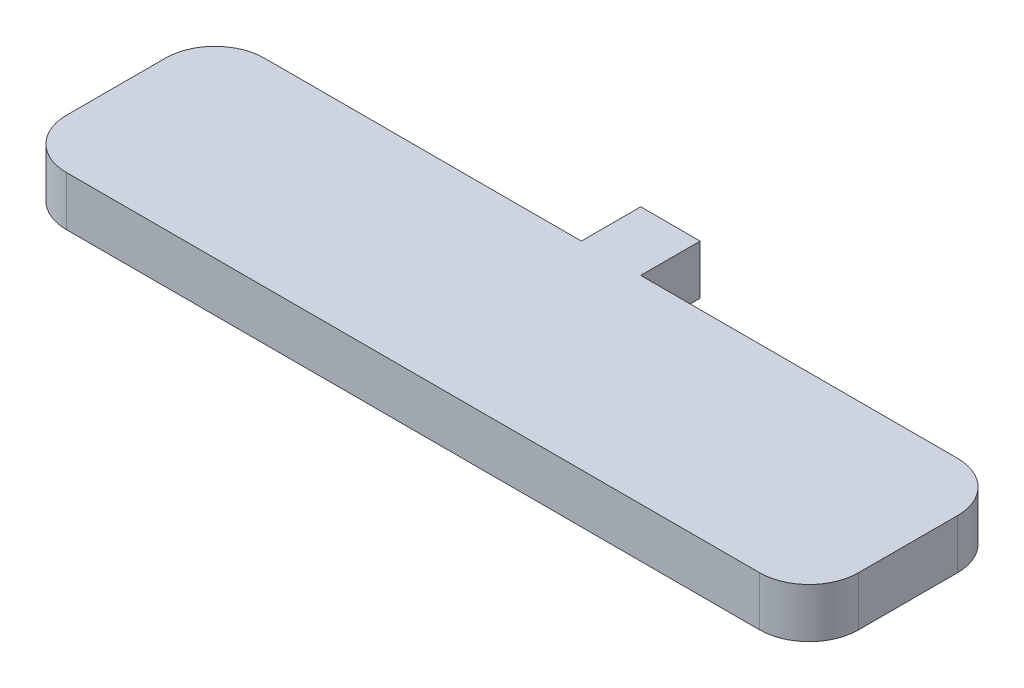
ISO-10303-21;
HEADER;
FILE_DESCRIPTION(('STEP AP214'),'2;1');
FILE_NAME('part.step','',(''),(''),'','','');
FILE_SCHEMA(('AUTOMOTIVE_DESIGN { 1 0 10303 214 1 1 1 1 }'));
ENDSEC;
DATA;
#1=APPLICATION_CONTEXT('core data for automotive mechanical design processes');
#2=APPLICATION_PROTOCOL_DEFINITION('international standard','automotive_design',2000,#1);
#3=PRODUCT_CONTEXT('',#1,'mechanical');
#4=PRODUCT('Part','Part','',(#3));
#5=PRODUCT_RELATED_PRODUCT_CATEGORY('part','',(#4));
#6=PRODUCT_DEFINITION_FORMATION('','',#4);
#7=PRODUCT_DEFINITION_CONTEXT('part definition',#1,'design');
#8=PRODUCT_DEFINITION('design','',#6,#7);
#9=PRODUCT_DEFINITION_SHAPE('','',#8);
#10=(LENGTH_UNIT() NAMED_UNIT(*) SI_UNIT(.MILLI.,.METRE.));
#11=(NAMED_UNIT(*) PLANE_ANGLE_UNIT() SI_UNIT($,.RADIAN.));
#12=(NAMED_UNIT(*) SI_UNIT($,.STERADIAN.) SOLID_ANGLE_UNIT());
#13=UNCERTAINTY_MEASURE_WITH_UNIT(LENGTH_MEASURE(1.E-05),#10,'distance_accuracy_value','');
#14=(GEOMETRIC_REPRESENTATION_CONTEXT(3) GLOBAL_UNCERTAINTY_ASSIGNED_CONTEXT((#13)) GLOBAL_UNIT_ASSIGNED_CONTEXT((#10,
#11,#12)) REPRESENTATION_CONTEXT('',''));
#15=CARTESIAN_POINT('',(0.,0.,0.));
#16=DIRECTION('',(0.,0.,1.));
#17=DIRECTION('',(1.,0.,0.));
#18=AXIS2_PLACEMENT_3D('',#15,#16,#17);
#19=CARTESIAN_POINT('',(40.,5.,-10.));
#20=DIRECTION('',(0.,0.,1.));
#21=DIRECTION('',(1.,0.,0.));
#22=AXIS2_PLACEMENT_3D('',#19,#20,#21);
#23=PLANE('',#22);
#24=DIRECTION('',(0.,1.,0.));
#25=VECTOR('',#24,1.);
#26=CARTESIAN_POINT('',(-3.,0.,-10.));
#27=LINE('',#26,#25);
#28=CARTESIAN_POINT('',(-3.,0.,-10.));
#29=VERTEX_POINT('',#28);
#30=CARTESIAN_POINT('',(-3.,5.,-10.));
#31=VERTEX_POINT('',#30);
#32=EDGE_CURVE('E55',#29,#31,#27,.T.);
#33=ORIENTED_EDGE('',*,*,#32,.F.);
#34=DIRECTION('',(-1.,0.,0.));
#35=VECTOR('',#34,1.);
#36=CARTESIAN_POINT('',(40.,0.,-10.));
#37=LINE('',#36,#35);
#38=CARTESIAN_POINT('',(-35.,0.,-10.));
#39=VERTEX_POINT('',#38);
#40=EDGE_CURVE('E316',#29,#39,#37,.T.);
#41=ORIENTED_EDGE('',*,*,#40,.T.);
#42=DIRECTION('',(0.,-1.,0.));
#43=VECTOR('',#42,1.);
#44=CARTESIAN_POINT('',(-35.,5.,-10.));
#45=LINE('',#44,#43);
#46=CARTESIAN_POINT('',(-35.,5.,-10.));
#47=VERTEX_POINT('',#46);
#48=EDGE_CURVE('E358',#39,#47,#45,.F.);
#49=ORIENTED_EDGE('',*,*,#48,.T.);
#50=DIRECTION('',(-1.,0.,0.));
#51=VECTOR('',#50,1.);
#52=CARTESIAN_POINT('',(40.,5.,-10.));
#53=LINE('',#52,#51);
#54=EDGE_CURVE('E300',#31,#47,#53,.T.);
#55=ORIENTED_EDGE('',*,*,#54,.F.);
#56=EDGE_LOOP('',(#33,#41,#49,#55));
#57=FACE_BOUND('',#56,.T.);
#58=ADVANCED_FACE('F39',(#57),#23,.F.);
#59=DIRECTION('',(0.,-1.,0.));
#60=VECTOR('',#59,1.);
#61=CARTESIAN_POINT('',(3.,0.,-10.));
#62=LINE('',#61,#60);
#63=CARTESIAN_POINT('',(3.,5.,-10.));
#64=VERTEX_POINT('',#63);
#65=CARTESIAN_POINT('',(3.,0.,-10.));
#66=VERTEX_POINT('',#65);
#67=EDGE_CURVE('E199',#64,#66,#62,.T.);
#68=ORIENTED_EDGE('',*,*,#67,.F.);
#69=CARTESIAN_POINT('',(35.,5.,-10.));
#70=VERTEX_POINT('',#69);
#71=EDGE_CURVE('E301',#70,#64,#53,.T.);
#72=ORIENTED_EDGE('',*,*,#71,.F.);
#73=DIRECTION('',(0.,-1.,0.));
#74=VECTOR('',#73,1.);
#75=CARTESIAN_POINT('',(35.,5.,-10.));
#76=LINE('',#75,#74);
#77=CARTESIAN_POINT('',(35.,0.,-10.));
#78=VERTEX_POINT('',#77);
#79=EDGE_CURVE('E362',#70,#78,#76,.T.);
#80=ORIENTED_EDGE('',*,*,#79,.T.);
#81=EDGE_CURVE('E293',#78,#66,#37,.T.);
#82=ORIENTED_EDGE('',*,*,#81,.T.);
#83=EDGE_LOOP('',(#68,#72,#80,#82));
#84=FACE_BOUND('',#83,.T.);
#85=ADVANCED_FACE('F401',(#84),#23,.F.);
#86=CARTESIAN_POINT('',(0.,0.,0.));
#87=DIRECTION('',(0.,1.,0.));
#88=DIRECTION('',(0.,0.,1.));
#89=AXIS2_PLACEMENT_3D('',#86,#87,#88);
#90=PLANE('',#89);
#91=DIRECTION('',(0.,0.,-1.));
#92=VECTOR('',#91,1.);
#93=CARTESIAN_POINT('',(40.,0.,9.99999999999999));
#94=LINE('',#93,#92);
#95=CARTESIAN_POINT('',(40.,0.,4.99999999999999));
#96=VERTEX_POINT('',#95);
#97=CARTESIAN_POINT('',(40.,0.,-5.00000000000001));
#98=VERTEX_POINT('',#97);
#99=EDGE_CURVE('E312',#96,#98,#94,.T.);
#100=ORIENTED_EDGE('',*,*,#99,.F.);
#101=CARTESIAN_POINT('',(35.,0.,4.99999999999999));
#102=DIRECTION('',(0.,1.,0.));
#103=DIRECTION('',(0.,0.,1.));
#104=AXIS2_PLACEMENT_3D('',#101,#102,#103);
#105=CIRCLE('',#104,5.);
#106=CARTESIAN_POINT('',(35.,0.,9.99999999999999));
#107=VERTEX_POINT('',#106);
#108=EDGE_CURVE('E336',#96,#107,#105,.F.);
#109=ORIENTED_EDGE('',*,*,#108,.T.);
#110=DIRECTION('',(1.,0.,0.));
#111=VECTOR('',#110,1.);
#112=CARTESIAN_POINT('',(40.,0.,9.99999999999999));
#113=LINE('',#112,#111);
#114=CARTESIAN_POINT('',(-35.,0.,9.99999999999999));
#115=VERTEX_POINT('',#114);
#116=EDGE_CURVE('E308',#115,#107,#113,.T.);
#117=ORIENTED_EDGE('',*,*,#116,.F.);
#118=CARTESIAN_POINT('',(-35.,0.,4.99999999999999));
#119=DIRECTION('',(0.,1.,0.));
#120=DIRECTION('',(0.,0.,1.));
#121=AXIS2_PLACEMENT_3D('',#118,#119,#120);
#122=CIRCLE('',#121,5.);
#123=CARTESIAN_POINT('',(-40.,0.,4.99999999999999));
#124=VERTEX_POINT('',#123);
#125=EDGE_CURVE('E326',#115,#124,#122,.F.);
#126=ORIENTED_EDGE('',*,*,#125,.T.);
#127=DIRECTION('',(0.,0.,1.));
#128=VECTOR('',#127,1.);
#129=CARTESIAN_POINT('',(-40.,0.,9.99999999999999));
#130=LINE('',#129,#128);
#131=CARTESIAN_POINT('',(-40.,0.,-5.));
#132=VERTEX_POINT('',#131);
#133=EDGE_CURVE('E222',#132,#124,#130,.T.);
#134=ORIENTED_EDGE('',*,*,#133,.F.);
#135=CARTESIAN_POINT('',(-35.,0.,-5.));
#136=DIRECTION('',(0.,1.,0.));
#137=DIRECTION('',(0.,0.,1.));
#138=AXIS2_PLACEMENT_3D('',#135,#136,#137);
#139=CIRCLE('',#138,5.);
#140=EDGE_CURVE('E329',#132,#39,#139,.F.);
#141=ORIENTED_EDGE('',*,*,#140,.T.);
#142=ORIENTED_EDGE('',*,*,#40,.F.);
#143=DIRECTION('',(0.,0.,1.));
#144=VECTOR('',#143,1.);
#145=CARTESIAN_POINT('',(-3.,0.,-16.));
#146=LINE('',#145,#144);
#147=CARTESIAN_POINT('',(-3.,0.,-16.));
#148=VERTEX_POINT('',#147);
#149=EDGE_CURVE('E406',#148,#29,#146,.T.);
#150=ORIENTED_EDGE('',*,*,#149,.F.);
#151=DIRECTION('',(-1.,0.,0.));
#152=VECTOR('',#151,1.);
#153=CARTESIAN_POINT('',(-3.,0.,-16.));
#154=LINE('',#153,#152);
#155=CARTESIAN_POINT('',(3.,0.,-16.));
#156=VERTEX_POINT('',#155);
#157=EDGE_CURVE('E196',#156,#148,#154,.T.);
#158=ORIENTED_EDGE('',*,*,#157,.F.);
#159=DIRECTION('',(0.,0.,1.));
#160=VECTOR('',#159,1.);
#161=CARTESIAN_POINT('',(3.,0.,-16.));
#162=LINE('',#161,#160);
#163=EDGE_CURVE('E210',#156,#66,#162,.T.);
#164=ORIENTED_EDGE('',*,*,#163,.T.);
#165=ORIENTED_EDGE('',*,*,#81,.F.);
#166=CARTESIAN_POINT('',(35.,0.,-5.00000000000001));
#167=DIRECTION('',(0.,1.,0.));
#168=DIRECTION('',(0.,0.,1.));
#169=AXIS2_PLACEMENT_3D('',#166,#167,#168);
#170=CIRCLE('',#169,5.);
#171=EDGE_CURVE('E333',#78,#98,#170,.F.);
#172=ORIENTED_EDGE('',*,*,#171,.T.);
#173=EDGE_LOOP('',(#100,#109,#117,#126,#134,#141,#142,#150,#158,#164,#165,#172));
#174=FACE_BOUND('',#173,.T.);
#175=CARTESIAN_POINT('',(35.,0.,4.99999999999999));
#176=DIRECTION('',(0.,1.,0.));
#177=DIRECTION('',(0.,0.,1.));
#178=AXIS2_PLACEMENT_3D('',#175,#176,#177);
#179=CIRCLE('',#178,3.);
#180=CARTESIAN_POINT('',(38.,0.,4.99999999999999));
#181=VERTEX_POINT('',#180);
#182=CARTESIAN_POINT('',(35.,0.,7.99999999999999));
#183=VERTEX_POINT('',#182);
#184=EDGE_CURVE('E258',#181,#183,#179,.F.);
#185=ORIENTED_EDGE('',*,*,#184,.F.);
#186=DIRECTION('',(0.,0.,-1.));
#187=VECTOR('',#186,1.);
#188=CARTESIAN_POINT('',(38.,0.,9.99999999999999));
#189=LINE('',#188,#187);
#190=CARTESIAN_POINT('',(38.,0.,-5.00000000000001));
#191=VERTEX_POINT('',#190);
#192=EDGE_CURVE('E275',#181,#191,#189,.T.);
#193=ORIENTED_EDGE('',*,*,#192,.T.);
#194=CARTESIAN_POINT('',(35.,0.,-5.00000000000001));
#195=DIRECTION('',(0.,1.,0.));
#196=DIRECTION('',(0.,0.,1.));
#197=AXIS2_PLACEMENT_3D('',#194,#195,#196);
#198=CIRCLE('',#197,3.);
#199=CARTESIAN_POINT('',(35.,0.,-8.00000000000001));
#200=VERTEX_POINT('',#199);
#201=EDGE_CURVE('E272',#200,#191,#198,.F.);
#202=ORIENTED_EDGE('',*,*,#201,.F.);
#203=DIRECTION('',(-1.,0.,0.));
#204=VECTOR('',#203,1.);
#205=CARTESIAN_POINT('',(40.,0.,-8.00000000000001));
#206=LINE('',#205,#204);
#207=CARTESIAN_POINT('',(-35.,0.,-8.00000000000001));
#208=VERTEX_POINT('',#207);
#209=EDGE_CURVE('E63',#200,#208,#206,.T.);
#210=ORIENTED_EDGE('',*,*,#209,.T.);
#211=CARTESIAN_POINT('',(-35.,0.,-5.));
#212=DIRECTION('',(0.,1.,0.));
#213=DIRECTION('',(0.,0.,1.));
#214=AXIS2_PLACEMENT_3D('',#211,#212,#213);
#215=CIRCLE('',#214,3.);
#216=CARTESIAN_POINT('',(-38.,0.,-5.));
#217=VERTEX_POINT('',#216);
#218=EDGE_CURVE('E269',#217,#208,#215,.F.);
#219=ORIENTED_EDGE('',*,*,#218,.F.);
#220=DIRECTION('',(0.,0.,1.));
#221=VECTOR('',#220,1.);
#222=CARTESIAN_POINT('',(-38.,0.,9.99999999999999));
#223=LINE('',#222,#221);
#224=CARTESIAN_POINT('',(-38.,0.,4.99999999999999));
#225=VERTEX_POINT('',#224);
#226=EDGE_CURVE('E203',#217,#225,#223,.T.);
#227=ORIENTED_EDGE('',*,*,#226,.T.);
#228=CARTESIAN_POINT('',(-35.,0.,4.99999999999999));
#229=DIRECTION('',(0.,1.,0.));
#230=DIRECTION('',(0.,0.,1.));
#231=AXIS2_PLACEMENT_3D('',#228,#229,#230);
#232=CIRCLE('',#231,3.);
#233=CARTESIAN_POINT('',(-35.,0.,7.99999999999999));
#234=VERTEX_POINT('',#233);
#235=EDGE_CURVE('E262',#234,#225,#232,.F.);
#236=ORIENTED_EDGE('',*,*,#235,.F.);
#237=DIRECTION('',(1.,0.,0.));
#238=VECTOR('',#237,1.);
#239=CARTESIAN_POINT('',(40.,0.,7.99999999999999));
#240=LINE('',#239,#238);
#241=EDGE_CURVE('E208',#234,#183,#240,.T.);
#242=ORIENTED_EDGE('',*,*,#241,.T.);
#243=EDGE_LOOP('',(#185,#193,#202,#210,#219,#227,#236,#242));
#244=FACE_BOUND('',#243,.T.);
#245=ADVANCED_FACE('F383',(#174,#244),#90,.F.);
#246=CARTESIAN_POINT('',(-40.,5.,9.99999999999999));
#247=DIRECTION('',(1.,0.,0.));
#248=DIRECTION('',(0.,0.,-1.));
#249=AXIS2_PLACEMENT_3D('',#246,#247,#248);
#250=PLANE('',#249);
#251=DIRECTION('',(0.,0.,1.));
#252=VECTOR('',#251,1.);
#253=CARTESIAN_POINT('',(-40.,5.,9.99999999999999));
#254=LINE('',#253,#252);
#255=CARTESIAN_POINT('',(-40.,5.,-5.));
#256=VERTEX_POINT('',#255);
#257=CARTESIAN_POINT('',(-40.,5.,4.99999999999999));
#258=VERTEX_POINT('',#257);
#259=EDGE_CURVE('E288',#256,#258,#254,.T.);
#260=ORIENTED_EDGE('',*,*,#259,.F.);
#261=DIRECTION('',(0.,-1.,0.));
#262=VECTOR('',#261,1.);
#263=CARTESIAN_POINT('',(-40.,5.,-5.));
#264=LINE('',#263,#262);
#265=EDGE_CURVE('E11',#256,#132,#264,.T.);
#266=ORIENTED_EDGE('',*,*,#265,.T.);
#267=ORIENTED_EDGE('',*,*,#133,.T.);
#268=DIRECTION('',(0.,-1.,0.));
#269=VECTOR('',#268,1.);
#270=CARTESIAN_POINT('',(-40.,5.,4.99999999999999));
#271=LINE('',#270,#269);
#272=EDGE_CURVE('E48',#124,#258,#271,.F.);
#273=ORIENTED_EDGE('',*,*,#272,.T.);
#274=EDGE_LOOP('',(#260,#266,#267,#273));
#275=FACE_BOUND('',#274,.T.);
#276=ADVANCED_FACE('F369',(#275),#250,.F.);
#277=CARTESIAN_POINT('',(40.,5.,9.99999999999999));
#278=DIRECTION('',(0.,0.,-1.));
#279=DIRECTION('',(-1.,0.,0.));
#280=AXIS2_PLACEMENT_3D('',#277,#278,#279);
#281=PLANE('',#280);
#282=ORIENTED_EDGE('',*,*,#116,.T.);
#283=DIRECTION('',(0.,-1.,0.));
#284=VECTOR('',#283,1.);
#285=CARTESIAN_POINT('',(35.,5.,9.99999999999999));
#286=LINE('',#285,#284);
#287=CARTESIAN_POINT('',(35.,5.,9.99999999999999));
#288=VERTEX_POINT('',#287);
#289=EDGE_CURVE('E343',#107,#288,#286,.F.);
#290=ORIENTED_EDGE('',*,*,#289,.T.);
#291=DIRECTION('',(1.,0.,0.));
#292=VECTOR('',#291,1.);
#293=CARTESIAN_POINT('',(40.,5.,9.99999999999999));
#294=LINE('',#293,#292);
#295=CARTESIAN_POINT('',(-35.,5.,9.99999999999999));
#296=VERTEX_POINT('',#295);
#297=EDGE_CURVE('E292',#296,#288,#294,.T.);
#298=ORIENTED_EDGE('',*,*,#297,.F.);
#299=DIRECTION('',(0.,-1.,0.));
#300=VECTOR('',#299,1.);
#301=CARTESIAN_POINT('',(-35.,5.,9.99999999999999));
#302=LINE('',#301,#300);
#303=EDGE_CURVE('E339',#296,#115,#302,.T.);
#304=ORIENTED_EDGE('',*,*,#303,.T.);
#305=EDGE_LOOP('',(#282,#290,#298,#304));
#306=FACE_BOUND('',#305,.T.);
#307=ADVANCED_FACE('F379',(#306),#281,.F.);
#308=CARTESIAN_POINT('',(40.,5.,9.99999999999999));
#309=DIRECTION('',(-1.,0.,0.));
#310=DIRECTION('',(0.,0.,1.));
#311=AXIS2_PLACEMENT_3D('',#308,#309,#310);
#312=PLANE('',#311);
#313=DIRECTION('',(0.,0.,-1.));
#314=VECTOR('',#313,1.);
#315=CARTESIAN_POINT('',(40.,5.,9.99999999999999));
#316=LINE('',#315,#314);
#317=CARTESIAN_POINT('',(40.,5.,4.99999999999999));
#318=VERTEX_POINT('',#317);
#319=CARTESIAN_POINT('',(40.,5.,-5.00000000000001));
#320=VERTEX_POINT('',#319);
#321=EDGE_CURVE('E296',#318,#320,#316,.T.);
#322=ORIENTED_EDGE('',*,*,#321,.F.);
#323=DIRECTION('',(0.,-1.,0.));
#324=VECTOR('',#323,1.);
#325=CARTESIAN_POINT('',(40.,5.,4.99999999999999));
#326=LINE('',#325,#324);
#327=EDGE_CURVE('E322',#318,#96,#326,.T.);
#328=ORIENTED_EDGE('',*,*,#327,.T.);
#329=ORIENTED_EDGE('',*,*,#99,.T.);
#330=DIRECTION('',(0.,-1.,0.));
#331=VECTOR('',#330,1.);
#332=CARTESIAN_POINT('',(40.,5.,-5.00000000000001));
#333=LINE('',#332,#331);
#334=EDGE_CURVE('E304',#98,#320,#333,.F.);
#335=ORIENTED_EDGE('',*,*,#334,.T.);
#336=EDGE_LOOP('',(#322,#328,#329,#335));
#337=FACE_BOUND('',#336,.T.);
#338=ADVANCED_FACE('F391',(#337),#312,.F.);
#339=CARTESIAN_POINT('',(0.,5.,0.));
#340=DIRECTION('',(0.,1.,0.));
#341=DIRECTION('',(0.,0.,1.));
#342=AXIS2_PLACEMENT_3D('',#339,#340,#341);
#343=PLANE('',#342);
#344=ORIENTED_EDGE('',*,*,#297,.T.);
#345=CARTESIAN_POINT('',(35.,5.,4.99999999999999));
#346=DIRECTION('',(0.,1.,0.));
#347=DIRECTION('',(0.,0.,1.));
#348=AXIS2_PLACEMENT_3D('',#345,#346,#347);
#349=CIRCLE('',#348,5.);
#350=EDGE_CURVE('E355',#288,#318,#349,.T.);
#351=ORIENTED_EDGE('',*,*,#350,.T.);
#352=ORIENTED_EDGE('',*,*,#321,.T.);
#353=CARTESIAN_POINT('',(35.,5.,-5.00000000000001));
#354=DIRECTION('',(0.,1.,0.));
#355=DIRECTION('',(0.,0.,1.));
#356=AXIS2_PLACEMENT_3D('',#353,#354,#355);
#357=CIRCLE('',#356,5.);
#358=EDGE_CURVE('E352',#320,#70,#357,.T.);
#359=ORIENTED_EDGE('',*,*,#358,.T.);
#360=ORIENTED_EDGE('',*,*,#71,.T.);
#361=DIRECTION('',(0.,0.,1.));
#362=VECTOR('',#361,1.);
#363=CARTESIAN_POINT('',(3.,5.,-16.));
#364=LINE('',#363,#362);
#365=CARTESIAN_POINT('',(3.,5.,-16.));
#366=VERTEX_POINT('',#365);
#367=EDGE_CURVE('E186',#366,#64,#364,.T.);
#368=ORIENTED_EDGE('',*,*,#367,.F.);
#369=DIRECTION('',(1.,0.,0.));
#370=VECTOR('',#369,1.);
#371=CARTESIAN_POINT('',(-3.,5.,-16.));
#372=LINE('',#371,#370);
#373=CARTESIAN_POINT('',(-3.,5.,-16.));
#374=VERTEX_POINT('',#373);
#375=EDGE_CURVE('E179',#374,#366,#372,.T.);
#376=ORIENTED_EDGE('',*,*,#375,.F.);
#377=DIRECTION('',(0.,0.,1.));
#378=VECTOR('',#377,1.);
#379=CARTESIAN_POINT('',(-3.,5.,-16.));
#380=LINE('',#379,#378);
#381=EDGE_CURVE('E183',#374,#31,#380,.T.);
#382=ORIENTED_EDGE('',*,*,#381,.T.);
#383=ORIENTED_EDGE('',*,*,#54,.T.);
#384=CARTESIAN_POINT('',(-35.,5.,-5.));
#385=DIRECTION('',(0.,1.,0.));
#386=DIRECTION('',(0.,0.,1.));
#387=AXIS2_PLACEMENT_3D('',#384,#385,#386);
#388=CIRCLE('',#387,5.);
#389=EDGE_CURVE('E349',#47,#256,#388,.T.);
#390=ORIENTED_EDGE('',*,*,#389,.T.);
#391=ORIENTED_EDGE('',*,*,#259,.T.);
#392=CARTESIAN_POINT('',(-35.,5.,4.99999999999999));
#393=DIRECTION('',(0.,1.,0.));
#394=DIRECTION('',(0.,0.,1.));
#395=AXIS2_PLACEMENT_3D('',#392,#393,#394);
#396=CIRCLE('',#395,5.);
#397=EDGE_CURVE('E346',#258,#296,#396,.T.);
#398=ORIENTED_EDGE('',*,*,#397,.T.);
#399=EDGE_LOOP('',(#344,#351,#352,#359,#360,#368,#376,#382,#383,#390,#391,#398));
#400=FACE_BOUND('',#399,.T.);
#401=ADVANCED_FACE('F182',(#400),#343,.T.);
#402=CARTESIAN_POINT('',(35.,5.,4.99999999999999));
#403=DIRECTION('',(0.,-1.,0.));
#404=DIRECTION('',(0.,0.,-1.));
#405=AXIS2_PLACEMENT_3D('',#402,#403,#404);
#406=CYLINDRICAL_SURFACE('',#405,5.);
#407=ORIENTED_EDGE('',*,*,#350,.F.);
#408=ORIENTED_EDGE('',*,*,#289,.F.);
#409=ORIENTED_EDGE('',*,*,#108,.F.);
#410=ORIENTED_EDGE('',*,*,#327,.F.);
#411=EDGE_LOOP('',(#407,#408,#409,#410));
#412=FACE_BOUND('',#411,.T.);
#413=ADVANCED_FACE('F388',(#412),#406,.T.);
#414=CARTESIAN_POINT('',(35.,5.,-5.00000000000001));
#415=DIRECTION('',(0.,-1.,0.));
#416=DIRECTION('',(0.,0.,-1.));
#417=AXIS2_PLACEMENT_3D('',#414,#415,#416);
#418=CYLINDRICAL_SURFACE('',#417,5.);
#419=ORIENTED_EDGE('',*,*,#358,.F.);
#420=ORIENTED_EDGE('',*,*,#334,.F.);
#421=ORIENTED_EDGE('',*,*,#171,.F.);
#422=ORIENTED_EDGE('',*,*,#79,.F.);
#423=EDGE_LOOP('',(#419,#420,#421,#422));
#424=FACE_BOUND('',#423,.T.);
#425=ADVANCED_FACE('F397',(#424),#418,.T.);
#426=CARTESIAN_POINT('',(-35.,5.,-5.));
#427=DIRECTION('',(0.,-1.,0.));
#428=DIRECTION('',(0.,0.,-1.));
#429=AXIS2_PLACEMENT_3D('',#426,#427,#428);
#430=CYLINDRICAL_SURFACE('',#429,5.);
#431=ORIENTED_EDGE('',*,*,#389,.F.);
#432=ORIENTED_EDGE('',*,*,#48,.F.);
#433=ORIENTED_EDGE('',*,*,#140,.F.);
#434=ORIENTED_EDGE('',*,*,#265,.F.);
#435=EDGE_LOOP('',(#431,#432,#433,#434));
#436=FACE_BOUND('',#435,.T.);
#437=ADVANCED_FACE('F460',(#436),#430,.T.);
#438=CARTESIAN_POINT('',(-35.,5.,4.99999999999999));
#439=DIRECTION('',(0.,-1.,0.));
#440=DIRECTION('',(0.,0.,-1.));
#441=AXIS2_PLACEMENT_3D('',#438,#439,#440);
#442=CYLINDRICAL_SURFACE('',#441,5.);
#443=ORIENTED_EDGE('',*,*,#397,.F.);
#444=ORIENTED_EDGE('',*,*,#272,.F.);
#445=ORIENTED_EDGE('',*,*,#125,.F.);
#446=ORIENTED_EDGE('',*,*,#303,.F.);
#447=EDGE_LOOP('',(#443,#444,#445,#446));
#448=FACE_BOUND('',#447,.T.);
#449=ADVANCED_FACE('F41',(#448),#442,.T.);
#450=CARTESIAN_POINT('',(-38.,5.,9.99999999999999));
#451=DIRECTION('',(1.,0.,0.));
#452=DIRECTION('',(0.,0.,-1.));
#453=AXIS2_PLACEMENT_3D('',#450,#451,#452);
#454=PLANE('',#453);
#455=DIRECTION('',(0.,0.,1.));
#456=VECTOR('',#455,1.);
#457=CARTESIAN_POINT('',(-38.,3.,9.99999999999999));
#458=LINE('',#457,#456);
#459=CARTESIAN_POINT('',(-38.,3.,-5.));
#460=VERTEX_POINT('',#459);
#461=CARTESIAN_POINT('',(-38.,3.,4.99999999999999));
#462=VERTEX_POINT('',#461);
#463=EDGE_CURVE('E214',#460,#462,#458,.T.);
#464=ORIENTED_EDGE('',*,*,#463,.T.);
#465=DIRECTION('',(0.,1.,0.));
#466=VECTOR('',#465,1.);
#467=CARTESIAN_POINT('',(-38.,5.,4.99999999999999));
#468=LINE('',#467,#466);
#469=EDGE_CURVE('E223',#225,#462,#468,.T.);
#470=ORIENTED_EDGE('',*,*,#469,.F.);
#471=ORIENTED_EDGE('',*,*,#226,.F.);
#472=DIRECTION('',(0.,1.,0.));
#473=VECTOR('',#472,1.);
#474=CARTESIAN_POINT('',(-38.,5.,-5.));
#475=LINE('',#474,#473);
#476=EDGE_CURVE('E219',#460,#217,#475,.F.);
#477=ORIENTED_EDGE('',*,*,#476,.F.);
#478=EDGE_LOOP('',(#464,#470,#471,#477));
#479=FACE_BOUND('',#478,.T.);
#480=ADVANCED_FACE('F466',(#479),#454,.T.);
#481=CARTESIAN_POINT('',(40.,5.,7.99999999999999));
#482=DIRECTION('',(0.,0.,-1.));
#483=DIRECTION('',(-1.,0.,0.));
#484=AXIS2_PLACEMENT_3D('',#481,#482,#483);
#485=PLANE('',#484);
#486=ORIENTED_EDGE('',*,*,#241,.F.);
#487=DIRECTION('',(0.,1.,0.));
#488=VECTOR('',#487,1.);
#489=CARTESIAN_POINT('',(-35.,5.,7.99999999999999));
#490=LINE('',#489,#488);
#491=CARTESIAN_POINT('',(-35.,3.,7.99999999999999));
#492=VERTEX_POINT('',#491);
#493=EDGE_CURVE('E255',#492,#234,#490,.F.);
#494=ORIENTED_EDGE('',*,*,#493,.F.);
#495=DIRECTION('',(1.,0.,0.));
#496=VECTOR('',#495,1.);
#497=CARTESIAN_POINT('',(40.,3.,7.99999999999999));
#498=LINE('',#497,#496);
#499=CARTESIAN_POINT('',(35.,3.,7.99999999999999));
#500=VERTEX_POINT('',#499);
#501=EDGE_CURVE('E218',#492,#500,#498,.T.);
#502=ORIENTED_EDGE('',*,*,#501,.T.);
#503=DIRECTION('',(0.,1.,0.));
#504=VECTOR('',#503,1.);
#505=CARTESIAN_POINT('',(35.,5.,7.99999999999999));
#506=LINE('',#505,#504);
#507=EDGE_CURVE('E252',#183,#500,#506,.T.);
#508=ORIENTED_EDGE('',*,*,#507,.F.);
#509=EDGE_LOOP('',(#486,#494,#502,#508));
#510=FACE_BOUND('',#509,.T.);
#511=ADVANCED_FACE('F474',(#510),#485,.T.);
#512=CARTESIAN_POINT('',(38.,5.,9.99999999999999));
#513=DIRECTION('',(-1.,0.,0.));
#514=DIRECTION('',(0.,0.,1.));
#515=AXIS2_PLACEMENT_3D('',#512,#513,#514);
#516=PLANE('',#515);
#517=DIRECTION('',(0.,0.,-1.));
#518=VECTOR('',#517,1.);
#519=CARTESIAN_POINT('',(38.,3.,9.99999999999999));
#520=LINE('',#519,#518);
#521=CARTESIAN_POINT('',(38.,3.,4.99999999999999));
#522=VERTEX_POINT('',#521);
#523=CARTESIAN_POINT('',(38.,3.,-5.00000000000001));
#524=VERTEX_POINT('',#523);
#525=EDGE_CURVE('E230',#522,#524,#520,.T.);
#526=ORIENTED_EDGE('',*,*,#525,.T.);
#527=DIRECTION('',(0.,1.,0.));
#528=VECTOR('',#527,1.);
#529=CARTESIAN_POINT('',(38.,5.,-5.00000000000001));
#530=LINE('',#529,#528);
#531=EDGE_CURVE('E246',#191,#524,#530,.T.);
#532=ORIENTED_EDGE('',*,*,#531,.F.);
#533=ORIENTED_EDGE('',*,*,#192,.F.);
#534=DIRECTION('',(0.,1.,0.));
#535=VECTOR('',#534,1.);
#536=CARTESIAN_POINT('',(38.,5.,4.99999999999999));
#537=LINE('',#536,#535);
#538=EDGE_CURVE('E259',#522,#181,#537,.F.);
#539=ORIENTED_EDGE('',*,*,#538,.F.);
#540=EDGE_LOOP('',(#526,#532,#533,#539));
#541=FACE_BOUND('',#540,.T.);
#542=ADVANCED_FACE('F480',(#541),#516,.T.);
#543=CARTESIAN_POINT('',(40.,5.,-8.00000000000001));
#544=DIRECTION('',(0.,0.,1.));
#545=DIRECTION('',(1.,0.,0.));
#546=AXIS2_PLACEMENT_3D('',#543,#544,#545);
#547=PLANE('',#546);
#548=DIRECTION('',(-1.,0.,0.));
#549=VECTOR('',#548,1.);
#550=CARTESIAN_POINT('',(40.,3.,-8.00000000000001));
#551=LINE('',#550,#549);
#552=CARTESIAN_POINT('',(35.,3.,-8.00000000000001));
#553=VERTEX_POINT('',#552);
#554=CARTESIAN_POINT('',(-35.,3.,-8.00000000000001));
#555=VERTEX_POINT('',#554);
#556=EDGE_CURVE('E239',#553,#555,#551,.T.);
#557=ORIENTED_EDGE('',*,*,#556,.T.);
#558=DIRECTION('',(0.,1.,0.));
#559=VECTOR('',#558,1.);
#560=CARTESIAN_POINT('',(-35.,5.,-8.00000000000001));
#561=LINE('',#560,#559);
#562=EDGE_CURVE('E234',#208,#555,#561,.T.);
#563=ORIENTED_EDGE('',*,*,#562,.F.);
#564=ORIENTED_EDGE('',*,*,#209,.F.);
#565=DIRECTION('',(0.,1.,0.));
#566=VECTOR('',#565,1.);
#567=CARTESIAN_POINT('',(35.,5.,-8.00000000000001));
#568=LINE('',#567,#566);
#569=EDGE_CURVE('E226',#553,#200,#568,.F.);
#570=ORIENTED_EDGE('',*,*,#569,.F.);
#571=EDGE_LOOP('',(#557,#563,#564,#570));
#572=FACE_BOUND('',#571,.T.);
#573=ADVANCED_FACE('F487',(#572),#547,.T.);
#574=CARTESIAN_POINT('',(0.,3.,0.));
#575=DIRECTION('',(0.,1.,0.));
#576=DIRECTION('',(0.,0.,1.));
#577=AXIS2_PLACEMENT_3D('',#574,#575,#576);
#578=PLANE('',#577);
#579=ORIENTED_EDGE('',*,*,#501,.F.);
#580=CARTESIAN_POINT('',(-35.,3.,4.99999999999999));
#581=DIRECTION('',(0.,1.,0.));
#582=DIRECTION('',(0.,0.,1.));
#583=AXIS2_PLACEMENT_3D('',#580,#581,#582);
#584=CIRCLE('',#583,3.);
#585=EDGE_CURVE('E249',#462,#492,#584,.T.);
#586=ORIENTED_EDGE('',*,*,#585,.F.);
#587=ORIENTED_EDGE('',*,*,#463,.F.);
#588=CARTESIAN_POINT('',(-35.,3.,-5.));
#589=DIRECTION('',(0.,1.,0.));
#590=DIRECTION('',(0.,0.,1.));
#591=AXIS2_PLACEMENT_3D('',#588,#589,#590);
#592=CIRCLE('',#591,3.);
#593=EDGE_CURVE('E242',#555,#460,#592,.T.);
#594=ORIENTED_EDGE('',*,*,#593,.F.);
#595=ORIENTED_EDGE('',*,*,#556,.F.);
#596=CARTESIAN_POINT('',(35.,3.,-5.00000000000001));
#597=DIRECTION('',(0.,1.,0.));
#598=DIRECTION('',(0.,0.,1.));
#599=AXIS2_PLACEMENT_3D('',#596,#597,#598);
#600=CIRCLE('',#599,3.);
#601=EDGE_CURVE('E235',#524,#553,#600,.T.);
#602=ORIENTED_EDGE('',*,*,#601,.F.);
#603=ORIENTED_EDGE('',*,*,#525,.F.);
#604=CARTESIAN_POINT('',(35.,3.,4.99999999999999));
#605=DIRECTION('',(0.,1.,0.));
#606=DIRECTION('',(0.,0.,1.));
#607=AXIS2_PLACEMENT_3D('',#604,#605,#606);
#608=CIRCLE('',#607,3.);
#609=EDGE_CURVE('E231',#500,#522,#608,.T.);
#610=ORIENTED_EDGE('',*,*,#609,.F.);
#611=EDGE_LOOP('',(#579,#586,#587,#594,#595,#602,#603,#610));
#612=FACE_BOUND('',#611,.T.);
#613=ADVANCED_FACE('F491',(#612),#578,.F.);
#614=CARTESIAN_POINT('',(35.,5.,4.99999999999999));
#615=DIRECTION('',(0.,-1.,0.));
#616=DIRECTION('',(0.,0.,-1.));
#617=AXIS2_PLACEMENT_3D('',#614,#615,#616);
#618=CYLINDRICAL_SURFACE('',#617,3.);
#619=ORIENTED_EDGE('',*,*,#609,.T.);
#620=ORIENTED_EDGE('',*,*,#538,.T.);
#621=ORIENTED_EDGE('',*,*,#184,.T.);
#622=ORIENTED_EDGE('',*,*,#507,.T.);
#623=EDGE_LOOP('',(#619,#620,#621,#622));
#624=FACE_BOUND('',#623,.T.);
#625=ADVANCED_FACE('F494',(#624),#618,.F.);
#626=CARTESIAN_POINT('',(35.,5.,-5.00000000000001));
#627=DIRECTION('',(0.,-1.,0.));
#628=DIRECTION('',(0.,0.,-1.));
#629=AXIS2_PLACEMENT_3D('',#626,#627,#628);
#630=CYLINDRICAL_SURFACE('',#629,3.);
#631=ORIENTED_EDGE('',*,*,#601,.T.);
#632=ORIENTED_EDGE('',*,*,#569,.T.);
#633=ORIENTED_EDGE('',*,*,#201,.T.);
#634=ORIENTED_EDGE('',*,*,#531,.T.);
#635=EDGE_LOOP('',(#631,#632,#633,#634));
#636=FACE_BOUND('',#635,.T.);
#637=ADVANCED_FACE('F498',(#636),#630,.F.);
#638=CARTESIAN_POINT('',(-35.,5.,-5.));
#639=DIRECTION('',(0.,-1.,0.));
#640=DIRECTION('',(0.,0.,-1.));
#641=AXIS2_PLACEMENT_3D('',#638,#639,#640);
#642=CYLINDRICAL_SURFACE('',#641,3.);
#643=ORIENTED_EDGE('',*,*,#593,.T.);
#644=ORIENTED_EDGE('',*,*,#476,.T.);
#645=ORIENTED_EDGE('',*,*,#218,.T.);
#646=ORIENTED_EDGE('',*,*,#562,.T.);
#647=EDGE_LOOP('',(#643,#644,#645,#646));
#648=FACE_BOUND('',#647,.T.);
#649=ADVANCED_FACE('F502',(#648),#642,.F.);
#650=CARTESIAN_POINT('',(-35.,5.,4.99999999999999));
#651=DIRECTION('',(0.,-1.,0.));
#652=DIRECTION('',(0.,0.,-1.));
#653=AXIS2_PLACEMENT_3D('',#650,#651,#652);
#654=CYLINDRICAL_SURFACE('',#653,3.);
#655=ORIENTED_EDGE('',*,*,#585,.T.);
#656=ORIENTED_EDGE('',*,*,#493,.T.);
#657=ORIENTED_EDGE('',*,*,#235,.T.);
#658=ORIENTED_EDGE('',*,*,#469,.T.);
#659=EDGE_LOOP('',(#655,#656,#657,#658));
#660=FACE_BOUND('',#659,.T.);
#661=ADVANCED_FACE('F506',(#660),#654,.F.);
#662=CARTESIAN_POINT('',(-3.,0.,-16.));
#663=DIRECTION('',(1.,0.,0.));
#664=DIRECTION('',(0.,1.,0.));
#665=AXIS2_PLACEMENT_3D('',#662,#663,#664);
#666=PLANE('',#665);
#667=ORIENTED_EDGE('',*,*,#32,.T.);
#668=ORIENTED_EDGE('',*,*,#381,.F.);
#669=DIRECTION('',(0.,1.,0.));
#670=VECTOR('',#669,1.);
#671=CARTESIAN_POINT('',(-3.,0.,-16.));
#672=LINE('',#671,#670);
#673=EDGE_CURVE('E191',#148,#374,#672,.T.);
#674=ORIENTED_EDGE('',*,*,#673,.F.);
#675=ORIENTED_EDGE('',*,*,#149,.T.);
#676=EDGE_LOOP('',(#667,#668,#674,#675));
#677=FACE_BOUND('',#676,.T.);
#678=ADVANCED_FACE('F201',(#677),#666,.F.);
#679=CARTESIAN_POINT('',(3.,0.,-16.));
#680=DIRECTION('',(-1.,0.,0.));
#681=DIRECTION('',(0.,-1.,0.));
#682=AXIS2_PLACEMENT_3D('',#679,#680,#681);
#683=PLANE('',#682);
#684=ORIENTED_EDGE('',*,*,#67,.T.);
#685=ORIENTED_EDGE('',*,*,#163,.F.);
#686=DIRECTION('',(0.,-1.,0.));
#687=VECTOR('',#686,1.);
#688=CARTESIAN_POINT('',(3.,0.,-16.));
#689=LINE('',#688,#687);
#690=EDGE_CURVE('E190',#366,#156,#689,.T.);
#691=ORIENTED_EDGE('',*,*,#690,.F.);
#692=ORIENTED_EDGE('',*,*,#367,.T.);
#693=EDGE_LOOP('',(#684,#685,#691,#692));
#694=FACE_BOUND('',#693,.T.);
#695=ADVANCED_FACE('F436',(#694),#683,.F.);
#696=CARTESIAN_POINT('',(0.,0.,-16.));
#697=DIRECTION('',(0.,0.,-1.));
#698=DIRECTION('',(-1.,0.,0.));
#699=AXIS2_PLACEMENT_3D('',#696,#697,#698);
#700=PLANE('',#699);
#701=CARTESIAN_POINT('',(0.,2.50000000000002,-16.));
#702=DIRECTION('',(0.,0.,-1.));
#703=DIRECTION('',(-1.,0.,0.));
#704=AXIS2_PLACEMENT_3D('',#701,#702,#703);
#705=CIRCLE('',#704,1.425);
#706=CARTESIAN_POINT('',(-1.425,2.50000000000002,-16.));
#707=VERTEX_POINT('',#706);
#708=EDGE_CURVE('E419',#707,#707,#705,.T.);
#709=ORIENTED_EDGE('',*,*,#708,.F.);
#710=EDGE_LOOP('',(#709));
#711=FACE_BOUND('',#710,.T.);
#712=ORIENTED_EDGE('',*,*,#673,.T.);
#713=ORIENTED_EDGE('',*,*,#375,.T.);
#714=ORIENTED_EDGE('',*,*,#690,.T.);
#715=ORIENTED_EDGE('',*,*,#157,.T.);
#716=EDGE_LOOP('',(#712,#713,#714,#715));
#717=FACE_BOUND('',#716,.T.);
#718=ADVANCED_FACE('F194',(#711,#717),#700,.T.);
#719=CARTESIAN_POINT('',(0.,2.50000000000002,-12.));
#720=DIRECTION('',(0.,0.,-1.));
#721=DIRECTION('',(-1.,0.,0.));
#722=AXIS2_PLACEMENT_3D('',#719,#720,#721);
#723=CYLINDRICAL_SURFACE('',#722,1.425);
#724=CARTESIAN_POINT('',(0.,2.50000000000002,-12.));
#725=DIRECTION('',(0.,0.,-1.));
#726=DIRECTION('',(-1.,0.,0.));
#727=AXIS2_PLACEMENT_3D('',#724,#725,#726);
#728=CIRCLE('',#727,1.425);
#729=CARTESIAN_POINT('',(-1.425,2.50000000000002,-12.));
#730=VERTEX_POINT('',#729);
#731=EDGE_CURVE('E414',#730,#730,#728,.T.);
#732=ORIENTED_EDGE('',*,*,#731,.F.);
#733=EDGE_LOOP('',(#732));
#734=FACE_BOUND('',#733,.T.);
#735=ORIENTED_EDGE('',*,*,#708,.T.);
#736=EDGE_LOOP('',(#735));
#737=FACE_BOUND('',#736,.T.);
#738=ADVANCED_FACE('F429',(#734,#737),#723,.F.);
#739=CARTESIAN_POINT('',(0.,2.50000000000002,-12.));
#740=DIRECTION('',(0.,0.,-1.));
#741=DIRECTION('',(-1.,0.,0.));
#742=AXIS2_PLACEMENT_3D('',#739,#740,#741);
#743=PLANE('',#742);
#744=ORIENTED_EDGE('',*,*,#731,.T.);
#745=EDGE_LOOP('',(#744));
#746=FACE_BOUND('',#745,.T.);
#747=ADVANCED_FACE('F427',(#746),#743,.T.);
#748=CLOSED_SHELL('',(#58,#85,#245,#276,#307,#338,#401,#413,#425,#437,#449,#480,#511,#542,#573,
#613,#625,#637,#649,#661,#678,#695,#718,#738,#747));
#749=MANIFOLD_SOLID_BREP('B2',#748);
#750=ADVANCED_BREP_SHAPE_REPRESENTATION('',(#18,#749),#14);
#751=SHAPE_DEFINITION_REPRESENTATION(#9,#750);
ENDSEC;
END-ISO-10303-21;
